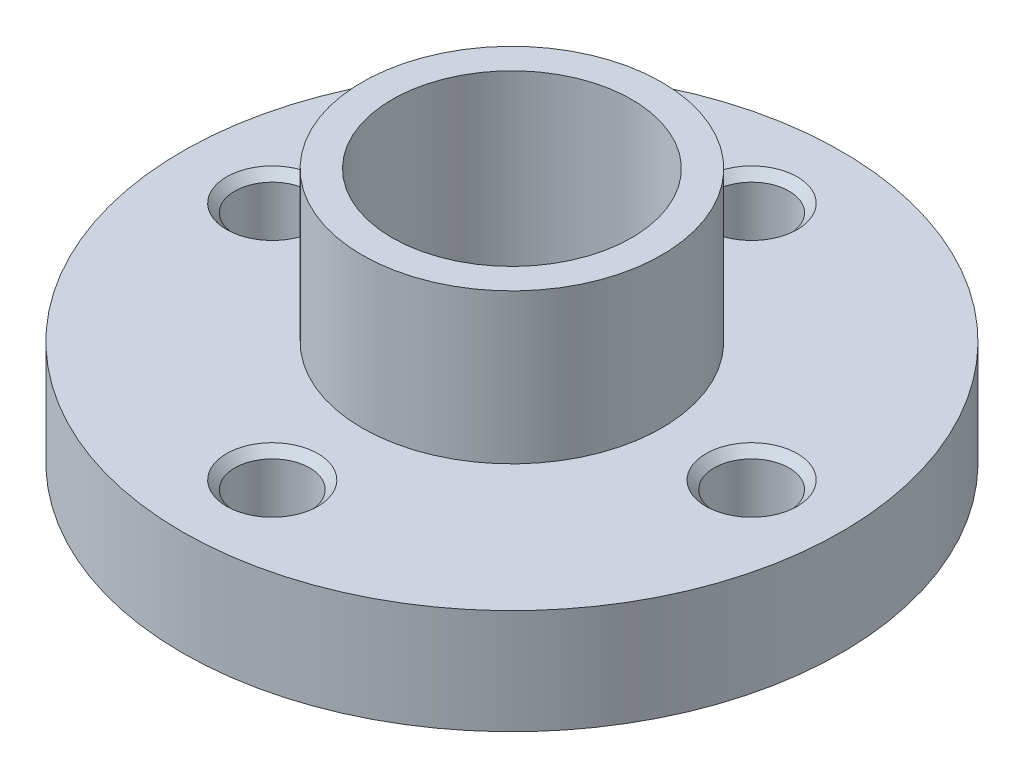
ISO-10303-21;
HEADER;
FILE_DESCRIPTION(('STEP AP214'),'2;1');
FILE_NAME('part.step','',(''),(''),'','','');
FILE_SCHEMA(('AUTOMOTIVE_DESIGN { 1 0 10303 214 1 1 1 1 }'));
ENDSEC;
DATA;
#1=APPLICATION_CONTEXT('core data for automotive mechanical design processes');
#2=APPLICATION_PROTOCOL_DEFINITION('international standard','automotive_design',2000,#1);
#3=PRODUCT_CONTEXT('',#1,'mechanical');
#4=PRODUCT('Part','Part','',(#3));
#5=PRODUCT_RELATED_PRODUCT_CATEGORY('part','',(#4));
#6=PRODUCT_DEFINITION_FORMATION('','',#4);
#7=PRODUCT_DEFINITION_CONTEXT('part definition',#1,'design');
#8=PRODUCT_DEFINITION('design','',#6,#7);
#9=PRODUCT_DEFINITION_SHAPE('','',#8);
#10=(LENGTH_UNIT() NAMED_UNIT(*) SI_UNIT(.MILLI.,.METRE.));
#11=(NAMED_UNIT(*) PLANE_ANGLE_UNIT() SI_UNIT($,.RADIAN.));
#12=(NAMED_UNIT(*) SI_UNIT($,.STERADIAN.) SOLID_ANGLE_UNIT());
#13=UNCERTAINTY_MEASURE_WITH_UNIT(LENGTH_MEASURE(1.E-05),#10,'distance_accuracy_value','');
#14=(GEOMETRIC_REPRESENTATION_CONTEXT(3) GLOBAL_UNCERTAINTY_ASSIGNED_CONTEXT((#13)) GLOBAL_UNIT_ASSIGNED_CONTEXT((#10,
#11,#12)) REPRESENTATION_CONTEXT('',''));
#15=CARTESIAN_POINT('',(0.,0.,0.));
#16=DIRECTION('',(0.,0.,1.));
#17=DIRECTION('',(1.,0.,0.));
#18=AXIS2_PLACEMENT_3D('',#15,#16,#17);
#19=CARTESIAN_POINT('',(0.,3.5,0.));
#20=DIRECTION('',(0.,-1.,0.));
#21=DIRECTION('',(0.,0.,-1.));
#22=AXIS2_PLACEMENT_3D('',#19,#20,#21);
#23=CYLINDRICAL_SURFACE('',#22,11.);
#24=CARTESIAN_POINT('',(0.,3.5,0.));
#25=DIRECTION('',(0.,1.,0.));
#26=DIRECTION('',(0.,0.,1.));
#27=AXIS2_PLACEMENT_3D('',#24,#25,#26);
#28=CIRCLE('',#27,11.);
#29=CARTESIAN_POINT('',(0.,3.5,11.));
#30=VERTEX_POINT('',#29);
#31=EDGE_CURVE('E43',#30,#30,#28,.T.);
#32=ORIENTED_EDGE('',*,*,#31,.F.);
#33=EDGE_LOOP('',(#32));
#34=FACE_BOUND('',#33,.T.);
#35=CARTESIAN_POINT('',(0.,0.,0.));
#36=DIRECTION('',(0.,1.,0.));
#37=DIRECTION('',(0.,0.,1.));
#38=AXIS2_PLACEMENT_3D('',#35,#36,#37);
#39=CIRCLE('',#38,11.);
#40=CARTESIAN_POINT('',(0.,0.,11.));
#41=VERTEX_POINT('',#40);
#42=EDGE_CURVE('E48',#41,#41,#39,.T.);
#43=ORIENTED_EDGE('',*,*,#42,.T.);
#44=EDGE_LOOP('',(#43));
#45=FACE_BOUND('',#44,.T.);
#46=ADVANCED_FACE('F36',(#34,#45),#23,.T.);
#47=CARTESIAN_POINT('',(0.,3.5,0.));
#48=DIRECTION('',(0.,1.,0.));
#49=DIRECTION('',(0.,0.,1.));
#50=AXIS2_PLACEMENT_3D('',#47,#48,#49);
#51=PLANE('',#50);
#52=CARTESIAN_POINT('',(0.,3.5,-8.));
#53=DIRECTION('',(0.,1.,0.));
#54=DIRECTION('',(0.,0.,1.));
#55=AXIS2_PLACEMENT_3D('',#52,#53,#54);
#56=CIRCLE('',#55,1.525);
#57=CARTESIAN_POINT('',(0.,3.5,-6.475));
#58=VERTEX_POINT('',#57);
#59=EDGE_CURVE('E187',#58,#58,#56,.T.);
#60=ORIENTED_EDGE('',*,*,#59,.F.);
#61=EDGE_LOOP('',(#60));
#62=FACE_BOUND('',#61,.T.);
#63=CARTESIAN_POINT('',(8.,3.5,0.));
#64=DIRECTION('',(0.,1.,0.));
#65=DIRECTION('',(0.,0.,1.));
#66=AXIS2_PLACEMENT_3D('',#63,#64,#65);
#67=CIRCLE('',#66,1.525);
#68=CARTESIAN_POINT('',(8.,3.5,1.525));
#69=VERTEX_POINT('',#68);
#70=EDGE_CURVE('E77',#69,#69,#67,.T.);
#71=ORIENTED_EDGE('',*,*,#70,.F.);
#72=EDGE_LOOP('',(#71));
#73=FACE_BOUND('',#72,.T.);
#74=CARTESIAN_POINT('',(0.,3.5,8.));
#75=DIRECTION('',(0.,1.,0.));
#76=DIRECTION('',(0.,0.,1.));
#77=AXIS2_PLACEMENT_3D('',#74,#75,#76);
#78=CIRCLE('',#77,1.525);
#79=CARTESIAN_POINT('',(0.,3.5,9.525));
#80=VERTEX_POINT('',#79);
#81=EDGE_CURVE('E70',#80,#80,#78,.T.);
#82=ORIENTED_EDGE('',*,*,#81,.F.);
#83=EDGE_LOOP('',(#82));
#84=FACE_BOUND('',#83,.T.);
#85=CARTESIAN_POINT('',(-8.,3.5,0.));
#86=DIRECTION('',(0.,1.,0.));
#87=DIRECTION('',(0.,0.,1.));
#88=AXIS2_PLACEMENT_3D('',#85,#86,#87);
#89=CIRCLE('',#88,1.525);
#90=CARTESIAN_POINT('',(-8.,3.5,1.525));
#91=VERTEX_POINT('',#90);
#92=EDGE_CURVE('E66',#91,#91,#89,.T.);
#93=ORIENTED_EDGE('',*,*,#92,.F.);
#94=EDGE_LOOP('',(#93));
#95=FACE_BOUND('',#94,.T.);
#96=CARTESIAN_POINT('',(0.,3.5,0.));
#97=DIRECTION('',(0.,1.,0.));
#98=DIRECTION('',(0.,0.,1.));
#99=AXIS2_PLACEMENT_3D('',#96,#97,#98);
#100=CIRCLE('',#99,5.);
#101=CARTESIAN_POINT('',(0.,3.5,5.));
#102=VERTEX_POINT('',#101);
#103=EDGE_CURVE('E10',#102,#102,#100,.T.);
#104=ORIENTED_EDGE('',*,*,#103,.F.);
#105=EDGE_LOOP('',(#104));
#106=FACE_BOUND('',#105,.T.);
#107=ORIENTED_EDGE('',*,*,#31,.T.);
#108=EDGE_LOOP('',(#107));
#109=FACE_BOUND('',#108,.T.);
#110=ADVANCED_FACE('F116',(#62,#73,#84,#95,#106,#109),#51,.T.);
#111=CARTESIAN_POINT('',(0.,0.,0.));
#112=DIRECTION('',(0.,1.,0.));
#113=DIRECTION('',(0.,0.,1.));
#114=AXIS2_PLACEMENT_3D('',#111,#112,#113);
#115=PLANE('',#114);
#116=CARTESIAN_POINT('',(0.,0.,-8.));
#117=DIRECTION('',(0.,1.,0.));
#118=DIRECTION('',(0.,0.,1.));
#119=AXIS2_PLACEMENT_3D('',#116,#117,#118);
#120=CIRCLE('',#119,1.24999999999999);
#121=CARTESIAN_POINT('',(0.,0.,-6.75000000000001));
#122=VERTEX_POINT('',#121);
#123=EDGE_CURVE('E39',#122,#122,#120,.T.);
#124=ORIENTED_EDGE('',*,*,#123,.T.);
#125=EDGE_LOOP('',(#124));
#126=FACE_BOUND('',#125,.T.);
#127=CARTESIAN_POINT('',(8.,0.,0.));
#128=DIRECTION('',(0.,1.,0.));
#129=DIRECTION('',(0.,0.,1.));
#130=AXIS2_PLACEMENT_3D('',#127,#128,#129);
#131=CIRCLE('',#130,1.24999999999999);
#132=CARTESIAN_POINT('',(8.,0.,1.24999999999999));
#133=VERTEX_POINT('',#132);
#134=EDGE_CURVE('E68',#133,#133,#131,.T.);
#135=ORIENTED_EDGE('',*,*,#134,.T.);
#136=EDGE_LOOP('',(#135));
#137=FACE_BOUND('',#136,.T.);
#138=CARTESIAN_POINT('',(0.,0.,8.));
#139=DIRECTION('',(0.,1.,0.));
#140=DIRECTION('',(0.,0.,1.));
#141=AXIS2_PLACEMENT_3D('',#138,#139,#140);
#142=CIRCLE('',#141,1.24999999999999);
#143=CARTESIAN_POINT('',(0.,0.,9.24999999999999));
#144=VERTEX_POINT('',#143);
#145=EDGE_CURVE('E64',#144,#144,#142,.T.);
#146=ORIENTED_EDGE('',*,*,#145,.T.);
#147=EDGE_LOOP('',(#146));
#148=FACE_BOUND('',#147,.T.);
#149=CARTESIAN_POINT('',(-8.,0.,0.));
#150=DIRECTION('',(0.,1.,0.));
#151=DIRECTION('',(0.,0.,1.));
#152=AXIS2_PLACEMENT_3D('',#149,#150,#151);
#153=CIRCLE('',#152,1.24999999999999);
#154=CARTESIAN_POINT('',(-8.,0.,1.25));
#155=VERTEX_POINT('',#154);
#156=EDGE_CURVE('E59',#155,#155,#153,.T.);
#157=ORIENTED_EDGE('',*,*,#156,.T.);
#158=EDGE_LOOP('',(#157));
#159=FACE_BOUND('',#158,.T.);
#160=CARTESIAN_POINT('',(0.,0.,0.));
#161=DIRECTION('',(0.,1.,0.));
#162=DIRECTION('',(0.,0.,1.));
#163=AXIS2_PLACEMENT_3D('',#160,#161,#162);
#164=CIRCLE('',#163,5.);
#165=CARTESIAN_POINT('',(0.,0.,5.));
#166=VERTEX_POINT('',#165);
#167=EDGE_CURVE('E56',#166,#166,#164,.T.);
#168=ORIENTED_EDGE('',*,*,#167,.T.);
#169=EDGE_LOOP('',(#168));
#170=FACE_BOUND('',#169,.T.);
#171=ORIENTED_EDGE('',*,*,#42,.F.);
#172=EDGE_LOOP('',(#171));
#173=FACE_BOUND('',#172,.T.);
#174=ADVANCED_FACE('F107',(#126,#137,#148,#159,#170,#173),#115,.F.);
#175=CARTESIAN_POINT('',(0.,-2.,0.));
#176=DIRECTION('',(0.,1.,0.));
#177=DIRECTION('',(0.,0.,1.));
#178=AXIS2_PLACEMENT_3D('',#175,#176,#177);
#179=PLANE('',#178);
#180=CARTESIAN_POINT('',(0.,-2.,0.));
#181=DIRECTION('',(0.,1.,0.));
#182=DIRECTION('',(0.,0.,1.));
#183=AXIS2_PLACEMENT_3D('',#180,#181,#182);
#184=CIRCLE('',#183,4.);
#185=CARTESIAN_POINT('',(0.,-2.,4.));
#186=VERTEX_POINT('',#185);
#187=EDGE_CURVE('E91',#186,#186,#184,.T.);
#188=ORIENTED_EDGE('',*,*,#187,.T.);
#189=EDGE_LOOP('',(#188));
#190=FACE_BOUND('',#189,.T.);
#191=CARTESIAN_POINT('',(0.,-2.,0.));
#192=DIRECTION('',(0.,1.,0.));
#193=DIRECTION('',(0.,0.,1.));
#194=AXIS2_PLACEMENT_3D('',#191,#192,#193);
#195=CIRCLE('',#194,5.);
#196=CARTESIAN_POINT('',(0.,-2.,5.));
#197=VERTEX_POINT('',#196);
#198=EDGE_CURVE('E51',#197,#197,#195,.T.);
#199=ORIENTED_EDGE('',*,*,#198,.F.);
#200=EDGE_LOOP('',(#199));
#201=FACE_BOUND('',#200,.T.);
#202=ADVANCED_FACE('F105',(#190,#201),#179,.F.);
#203=CARTESIAN_POINT('',(0.,-2.,0.));
#204=DIRECTION('',(0.,1.,0.));
#205=DIRECTION('',(0.,0.,1.));
#206=AXIS2_PLACEMENT_3D('',#203,#204,#205);
#207=CYLINDRICAL_SURFACE('',#206,5.);
#208=ORIENTED_EDGE('',*,*,#198,.T.);
#209=EDGE_LOOP('',(#208));
#210=FACE_BOUND('',#209,.T.);
#211=ORIENTED_EDGE('',*,*,#167,.F.);
#212=EDGE_LOOP('',(#211));
#213=FACE_BOUND('',#212,.T.);
#214=ADVANCED_FACE('F102',(#210,#213),#207,.T.);
#215=ORIENTED_EDGE('',*,*,#103,.T.);
#216=EDGE_LOOP('',(#215));
#217=FACE_BOUND('',#216,.T.);
#218=CARTESIAN_POINT('',(0.,8.5,0.));
#219=DIRECTION('',(0.,1.,0.));
#220=DIRECTION('',(0.,0.,1.));
#221=AXIS2_PLACEMENT_3D('',#218,#219,#220);
#222=CIRCLE('',#221,5.);
#223=CARTESIAN_POINT('',(0.,8.5,5.));
#224=VERTEX_POINT('',#223);
#225=EDGE_CURVE('E94',#224,#224,#222,.T.);
#226=ORIENTED_EDGE('',*,*,#225,.F.);
#227=EDGE_LOOP('',(#226));
#228=FACE_BOUND('',#227,.T.);
#229=ADVANCED_FACE('F114',(#217,#228),#207,.T.);
#230=CARTESIAN_POINT('',(0.,8.5,0.));
#231=DIRECTION('',(0.,1.,0.));
#232=DIRECTION('',(0.,0.,1.));
#233=AXIS2_PLACEMENT_3D('',#230,#231,#232);
#234=PLANE('',#233);
#235=CARTESIAN_POINT('',(0.,8.5,0.));
#236=DIRECTION('',(0.,1.,0.));
#237=DIRECTION('',(0.,0.,1.));
#238=AXIS2_PLACEMENT_3D('',#235,#236,#237);
#239=CIRCLE('',#238,4.);
#240=CARTESIAN_POINT('',(0.,8.5,4.));
#241=VERTEX_POINT('',#240);
#242=EDGE_CURVE('E62',#241,#241,#239,.T.);
#243=ORIENTED_EDGE('',*,*,#242,.F.);
#244=EDGE_LOOP('',(#243));
#245=FACE_BOUND('',#244,.T.);
#246=ORIENTED_EDGE('',*,*,#225,.T.);
#247=EDGE_LOOP('',(#246));
#248=FACE_BOUND('',#247,.T.);
#249=ADVANCED_FACE('F136',(#245,#248),#234,.T.);
#250=CARTESIAN_POINT('',(0.,-2.,0.));
#251=DIRECTION('',(0.,1.,0.));
#252=DIRECTION('',(0.,0.,1.));
#253=AXIS2_PLACEMENT_3D('',#250,#251,#252);
#254=CYLINDRICAL_SURFACE('',#253,4.);
#255=ORIENTED_EDGE('',*,*,#187,.F.);
#256=EDGE_LOOP('',(#255));
#257=FACE_BOUND('',#256,.T.);
#258=ORIENTED_EDGE('',*,*,#242,.T.);
#259=EDGE_LOOP('',(#258));
#260=FACE_BOUND('',#259,.T.);
#261=ADVANCED_FACE('F140',(#257,#260),#254,.F.);
#262=CARTESIAN_POINT('',(-8.,3.5,0.));
#263=DIRECTION('',(0.,1.,0.));
#264=DIRECTION('',(0.,0.,1.));
#265=AXIS2_PLACEMENT_3D('',#262,#263,#264);
#266=CYLINDRICAL_SURFACE('',#265,1.24999999999999);
#267=CARTESIAN_POINT('',(-8.,3.225,0.));
#268=DIRECTION('',(0.,1.,0.));
#269=DIRECTION('',(0.,0.,1.));
#270=AXIS2_PLACEMENT_3D('',#267,#268,#269);
#271=CIRCLE('',#270,1.25);
#272=CARTESIAN_POINT('',(-8.,3.225,1.25));
#273=VERTEX_POINT('',#272);
#274=EDGE_CURVE('E63',#273,#273,#271,.T.);
#275=ORIENTED_EDGE('',*,*,#274,.T.);
#276=EDGE_LOOP('',(#275));
#277=FACE_BOUND('',#276,.T.);
#278=ORIENTED_EDGE('',*,*,#156,.F.);
#279=EDGE_LOOP('',(#278));
#280=FACE_BOUND('',#279,.T.);
#281=ADVANCED_FACE('F146',(#277,#280),#266,.F.);
#282=CARTESIAN_POINT('',(-8.,3.5,0.));
#283=DIRECTION('',(0.,1.,0.));
#284=DIRECTION('',(0.,0.,1.));
#285=AXIS2_PLACEMENT_3D('',#282,#283,#284);
#286=CONICAL_SURFACE('',#285,1.525,0.785398163397445);
#287=ORIENTED_EDGE('',*,*,#274,.F.);
#288=EDGE_LOOP('',(#287));
#289=FACE_BOUND('',#288,.T.);
#290=ORIENTED_EDGE('',*,*,#92,.T.);
#291=EDGE_LOOP('',(#290));
#292=FACE_BOUND('',#291,.T.);
#293=ADVANCED_FACE('F153',(#289,#292),#286,.F.);
#294=CARTESIAN_POINT('',(0.,3.5,8.));
#295=DIRECTION('',(0.,1.,0.));
#296=DIRECTION('',(0.,0.,1.));
#297=AXIS2_PLACEMENT_3D('',#294,#295,#296);
#298=CYLINDRICAL_SURFACE('',#297,1.24999999999999);
#299=CARTESIAN_POINT('',(0.,3.225,8.));
#300=DIRECTION('',(0.,1.,0.));
#301=DIRECTION('',(0.,0.,1.));
#302=AXIS2_PLACEMENT_3D('',#299,#300,#301);
#303=CIRCLE('',#302,1.25);
#304=CARTESIAN_POINT('',(0.,3.225,9.25));
#305=VERTEX_POINT('',#304);
#306=EDGE_CURVE('E67',#305,#305,#303,.T.);
#307=ORIENTED_EDGE('',*,*,#306,.T.);
#308=EDGE_LOOP('',(#307));
#309=FACE_BOUND('',#308,.T.);
#310=ORIENTED_EDGE('',*,*,#145,.F.);
#311=EDGE_LOOP('',(#310));
#312=FACE_BOUND('',#311,.T.);
#313=ADVANCED_FACE('F157',(#309,#312),#298,.F.);
#314=CARTESIAN_POINT('',(0.,3.5,8.));
#315=DIRECTION('',(0.,1.,0.));
#316=DIRECTION('',(0.,0.,1.));
#317=AXIS2_PLACEMENT_3D('',#314,#315,#316);
#318=CONICAL_SURFACE('',#317,1.525,0.785398163397446);
#319=ORIENTED_EDGE('',*,*,#306,.F.);
#320=EDGE_LOOP('',(#319));
#321=FACE_BOUND('',#320,.T.);
#322=ORIENTED_EDGE('',*,*,#81,.T.);
#323=EDGE_LOOP('',(#322));
#324=FACE_BOUND('',#323,.T.);
#325=ADVANCED_FACE('F161',(#321,#324),#318,.F.);
#326=CARTESIAN_POINT('',(8.,3.5,0.));
#327=DIRECTION('',(0.,1.,0.));
#328=DIRECTION('',(0.,0.,1.));
#329=AXIS2_PLACEMENT_3D('',#326,#327,#328);
#330=CYLINDRICAL_SURFACE('',#329,1.24999999999999);
#331=CARTESIAN_POINT('',(8.,3.225,0.));
#332=DIRECTION('',(0.,1.,0.));
#333=DIRECTION('',(0.,0.,1.));
#334=AXIS2_PLACEMENT_3D('',#331,#332,#333);
#335=CIRCLE('',#334,1.25);
#336=CARTESIAN_POINT('',(8.,3.225,1.25));
#337=VERTEX_POINT('',#336);
#338=EDGE_CURVE('E71',#337,#337,#335,.T.);
#339=ORIENTED_EDGE('',*,*,#338,.T.);
#340=EDGE_LOOP('',(#339));
#341=FACE_BOUND('',#340,.T.);
#342=ORIENTED_EDGE('',*,*,#134,.F.);
#343=EDGE_LOOP('',(#342));
#344=FACE_BOUND('',#343,.T.);
#345=ADVANCED_FACE('F165',(#341,#344),#330,.F.);
#346=CARTESIAN_POINT('',(8.,3.5,0.));
#347=DIRECTION('',(0.,1.,0.));
#348=DIRECTION('',(0.,0.,1.));
#349=AXIS2_PLACEMENT_3D('',#346,#347,#348);
#350=CONICAL_SURFACE('',#349,1.525,0.785398163397445);
#351=ORIENTED_EDGE('',*,*,#338,.F.);
#352=EDGE_LOOP('',(#351));
#353=FACE_BOUND('',#352,.T.);
#354=ORIENTED_EDGE('',*,*,#70,.T.);
#355=EDGE_LOOP('',(#354));
#356=FACE_BOUND('',#355,.T.);
#357=ADVANCED_FACE('F169',(#353,#356),#350,.F.);
#358=CARTESIAN_POINT('',(0.,3.5,-8.));
#359=DIRECTION('',(0.,1.,0.));
#360=DIRECTION('',(0.,0.,1.));
#361=AXIS2_PLACEMENT_3D('',#358,#359,#360);
#362=CYLINDRICAL_SURFACE('',#361,1.24999999999999);
#363=CARTESIAN_POINT('',(0.,3.225,-8.));
#364=DIRECTION('',(0.,1.,0.));
#365=DIRECTION('',(0.,0.,1.));
#366=AXIS2_PLACEMENT_3D('',#363,#364,#365);
#367=CIRCLE('',#366,1.25);
#368=CARTESIAN_POINT('',(0.,3.225,-6.75));
#369=VERTEX_POINT('',#368);
#370=EDGE_CURVE('E185',#369,#369,#367,.T.);
#371=ORIENTED_EDGE('',*,*,#370,.T.);
#372=EDGE_LOOP('',(#371));
#373=FACE_BOUND('',#372,.T.);
#374=ORIENTED_EDGE('',*,*,#123,.F.);
#375=EDGE_LOOP('',(#374));
#376=FACE_BOUND('',#375,.T.);
#377=ADVANCED_FACE('F172',(#373,#376),#362,.F.);
#378=CARTESIAN_POINT('',(0.,3.5,-8.));
#379=DIRECTION('',(0.,1.,0.));
#380=DIRECTION('',(0.,0.,1.));
#381=AXIS2_PLACEMENT_3D('',#378,#379,#380);
#382=CONICAL_SURFACE('',#381,1.525,0.785398163397446);
#383=ORIENTED_EDGE('',*,*,#370,.F.);
#384=EDGE_LOOP('',(#383));
#385=FACE_BOUND('',#384,.T.);
#386=ORIENTED_EDGE('',*,*,#59,.T.);
#387=EDGE_LOOP('',(#386));
#388=FACE_BOUND('',#387,.T.);
#389=ADVANCED_FACE('F176',(#385,#388),#382,.F.);
#390=CLOSED_SHELL('',(#46,#110,#174,#202,#214,#229,#249,#261,#281,#293,#313,#325,#345,#357,#377,#389));
#391=MANIFOLD_SOLID_BREP('B2',#390);
#392=ADVANCED_BREP_SHAPE_REPRESENTATION('',(#18,#391),#14);
#393=SHAPE_DEFINITION_REPRESENTATION(#9,#392);
ENDSEC;
END-ISO-10303-21;
